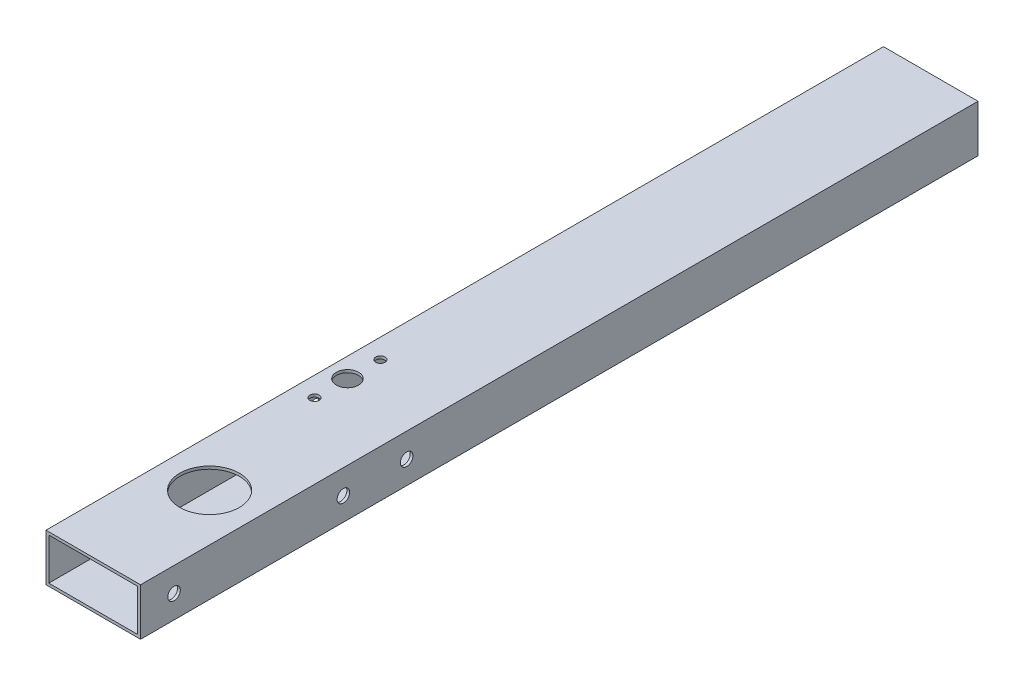
ISO-10303-21;
HEADER;
FILE_DESCRIPTION(('STEP AP214'),'2;1');
FILE_NAME('part.step','',(''),(''),'','','');
FILE_SCHEMA(('AUTOMOTIVE_DESIGN { 1 0 10303 214 1 1 1 1 }'));
ENDSEC;
DATA;
#1=APPLICATION_CONTEXT('core data for automotive mechanical design processes');
#2=APPLICATION_PROTOCOL_DEFINITION('international standard','automotive_design',2000,#1);
#3=PRODUCT_CONTEXT('',#1,'mechanical');
#4=PRODUCT('Part','Part','',(#3));
#5=PRODUCT_RELATED_PRODUCT_CATEGORY('part','',(#4));
#6=PRODUCT_DEFINITION_FORMATION('','',#4);
#7=PRODUCT_DEFINITION_CONTEXT('part definition',#1,'design');
#8=PRODUCT_DEFINITION('design','',#6,#7);
#9=PRODUCT_DEFINITION_SHAPE('','',#8);
#10=(LENGTH_UNIT() NAMED_UNIT(*) SI_UNIT(.MILLI.,.METRE.));
#11=(NAMED_UNIT(*) PLANE_ANGLE_UNIT() SI_UNIT($,.RADIAN.));
#12=(NAMED_UNIT(*) SI_UNIT($,.STERADIAN.) SOLID_ANGLE_UNIT());
#13=UNCERTAINTY_MEASURE_WITH_UNIT(LENGTH_MEASURE(1.E-05),#10,'distance_accuracy_value','');
#14=(GEOMETRIC_REPRESENTATION_CONTEXT(3) GLOBAL_UNCERTAINTY_ASSIGNED_CONTEXT((#13)) GLOBAL_UNIT_ASSIGNED_CONTEXT((#10,
#11,#12)) REPRESENTATION_CONTEXT('',''));
#15=CARTESIAN_POINT('',(0.,0.,0.));
#16=DIRECTION('',(0.,0.,1.));
#17=DIRECTION('',(1.,0.,0.));
#18=AXIS2_PLACEMENT_3D('',#15,#16,#17);
#19=CARTESIAN_POINT('',(0.,0.,450.));
#20=DIRECTION('',(0.,0.,-1.));
#21=DIRECTION('',(-1.,0.,0.));
#22=AXIS2_PLACEMENT_3D('',#19,#20,#21);
#23=PLANE('',#22);
#24=DIRECTION('',(0.,1.,0.));
#25=VECTOR('',#24,1.);
#26=CARTESIAN_POINT('',(25.4,-12.7,450.));
#27=LINE('',#26,#25);
#28=CARTESIAN_POINT('',(25.4,-12.7,450.));
#29=VERTEX_POINT('',#28);
#30=CARTESIAN_POINT('',(25.4,12.6999999999999,450.));
#31=VERTEX_POINT('',#30);
#32=EDGE_CURVE('E141',#29,#31,#27,.T.);
#33=ORIENTED_EDGE('',*,*,#32,.T.);
#34=DIRECTION('',(-1.,0.,0.));
#35=VECTOR('',#34,1.);
#36=CARTESIAN_POINT('',(-25.4,12.6999999999999,450.));
#37=LINE('',#36,#35);
#38=CARTESIAN_POINT('',(-25.4,12.6999999999999,450.));
#39=VERTEX_POINT('',#38);
#40=EDGE_CURVE('E144',#31,#39,#37,.T.);
#41=ORIENTED_EDGE('',*,*,#40,.T.);
#42=DIRECTION('',(0.,-1.,0.));
#43=VECTOR('',#42,1.);
#44=CARTESIAN_POINT('',(-25.4,-12.7,450.));
#45=LINE('',#44,#43);
#46=CARTESIAN_POINT('',(-25.4,-12.7,450.));
#47=VERTEX_POINT('',#46);
#48=EDGE_CURVE('E147',#39,#47,#45,.T.);
#49=ORIENTED_EDGE('',*,*,#48,.T.);
#50=DIRECTION('',(1.,0.,0.));
#51=VECTOR('',#50,1.);
#52=CARTESIAN_POINT('',(-25.4,-12.7,450.));
#53=LINE('',#52,#51);
#54=EDGE_CURVE('E149',#47,#29,#53,.T.);
#55=ORIENTED_EDGE('',*,*,#54,.T.);
#56=EDGE_LOOP('',(#33,#41,#49,#55));
#57=FACE_BOUND('',#56,.T.);
#58=DIRECTION('',(0.,-1.,0.));
#59=VECTOR('',#58,1.);
#60=CARTESIAN_POINT('',(-23.9,-11.2,450.));
#61=LINE('',#60,#59);
#62=CARTESIAN_POINT('',(-23.9,11.1999999999999,450.));
#63=VERTEX_POINT('',#62);
#64=CARTESIAN_POINT('',(-23.9,-11.2,450.));
#65=VERTEX_POINT('',#64);
#66=EDGE_CURVE('E103',#63,#65,#61,.T.);
#67=ORIENTED_EDGE('',*,*,#66,.F.);
#68=DIRECTION('',(-1.,0.,0.));
#69=VECTOR('',#68,1.);
#70=CARTESIAN_POINT('',(-23.9,11.1999999999999,450.));
#71=LINE('',#70,#69);
#72=CARTESIAN_POINT('',(23.9,11.1999999999999,450.));
#73=VERTEX_POINT('',#72);
#74=EDGE_CURVE('E125',#73,#63,#71,.T.);
#75=ORIENTED_EDGE('',*,*,#74,.F.);
#76=DIRECTION('',(0.,1.,0.));
#77=VECTOR('',#76,1.);
#78=CARTESIAN_POINT('',(23.9,-11.2,450.));
#79=LINE('',#78,#77);
#80=CARTESIAN_POINT('',(23.9,-11.2,450.));
#81=VERTEX_POINT('',#80);
#82=EDGE_CURVE('E123',#81,#73,#79,.T.);
#83=ORIENTED_EDGE('',*,*,#82,.F.);
#84=DIRECTION('',(1.,0.,0.));
#85=VECTOR('',#84,1.);
#86=CARTESIAN_POINT('',(-23.9,-11.2,450.));
#87=LINE('',#86,#85);
#88=EDGE_CURVE('E111',#65,#81,#87,.T.);
#89=ORIENTED_EDGE('',*,*,#88,.F.);
#90=EDGE_LOOP('',(#67,#75,#83,#89));
#91=FACE_BOUND('',#90,.T.);
#92=ADVANCED_FACE('F36',(#57,#91),#23,.F.);
#93=CARTESIAN_POINT('',(0.,0.,0.));
#94=DIRECTION('',(0.,0.,-1.));
#95=DIRECTION('',(-1.,0.,0.));
#96=AXIS2_PLACEMENT_3D('',#93,#94,#95);
#97=PLANE('',#96);
#98=DIRECTION('',(0.,1.,0.));
#99=VECTOR('',#98,1.);
#100=CARTESIAN_POINT('',(25.4,-12.7,0.));
#101=LINE('',#100,#99);
#102=CARTESIAN_POINT('',(25.4,-12.7,0.));
#103=VERTEX_POINT('',#102);
#104=CARTESIAN_POINT('',(25.4,12.6999999999999,0.));
#105=VERTEX_POINT('',#104);
#106=EDGE_CURVE('E119',#103,#105,#101,.T.);
#107=ORIENTED_EDGE('',*,*,#106,.F.);
#108=DIRECTION('',(1.,0.,0.));
#109=VECTOR('',#108,1.);
#110=CARTESIAN_POINT('',(-25.4,-12.7,0.));
#111=LINE('',#110,#109);
#112=CARTESIAN_POINT('',(-25.4,-12.7,0.));
#113=VERTEX_POINT('',#112);
#114=EDGE_CURVE('E145',#113,#103,#111,.T.);
#115=ORIENTED_EDGE('',*,*,#114,.F.);
#116=DIRECTION('',(0.,-1.,0.));
#117=VECTOR('',#116,1.);
#118=CARTESIAN_POINT('',(-25.4,-12.7,0.));
#119=LINE('',#118,#117);
#120=CARTESIAN_POINT('',(-25.4,12.6999999999999,0.));
#121=VERTEX_POINT('',#120);
#122=EDGE_CURVE('E156',#121,#113,#119,.T.);
#123=ORIENTED_EDGE('',*,*,#122,.F.);
#124=DIRECTION('',(-1.,0.,0.));
#125=VECTOR('',#124,1.);
#126=CARTESIAN_POINT('',(-25.4,12.6999999999999,0.));
#127=LINE('',#126,#125);
#128=EDGE_CURVE('E154',#105,#121,#127,.T.);
#129=ORIENTED_EDGE('',*,*,#128,.F.);
#130=EDGE_LOOP('',(#107,#115,#123,#129));
#131=FACE_BOUND('',#130,.T.);
#132=DIRECTION('',(-1.,0.,0.));
#133=VECTOR('',#132,1.);
#134=CARTESIAN_POINT('',(-23.9,11.1999999999999,0.));
#135=LINE('',#134,#133);
#136=CARTESIAN_POINT('',(23.9,11.1999999999999,0.));
#137=VERTEX_POINT('',#136);
#138=CARTESIAN_POINT('',(-23.9,11.1999999999999,0.));
#139=VERTEX_POINT('',#138);
#140=EDGE_CURVE('E112',#137,#139,#135,.T.);
#141=ORIENTED_EDGE('',*,*,#140,.T.);
#142=DIRECTION('',(0.,-1.,0.));
#143=VECTOR('',#142,1.);
#144=CARTESIAN_POINT('',(-23.9,-11.2,0.));
#145=LINE('',#144,#143);
#146=CARTESIAN_POINT('',(-23.9,-11.2,0.));
#147=VERTEX_POINT('',#146);
#148=EDGE_CURVE('E61',#139,#147,#145,.T.);
#149=ORIENTED_EDGE('',*,*,#148,.T.);
#150=DIRECTION('',(1.,0.,0.));
#151=VECTOR('',#150,1.);
#152=CARTESIAN_POINT('',(-23.9,-11.2,0.));
#153=LINE('',#152,#151);
#154=CARTESIAN_POINT('',(23.9,-11.2,0.));
#155=VERTEX_POINT('',#154);
#156=EDGE_CURVE('E118',#147,#155,#153,.T.);
#157=ORIENTED_EDGE('',*,*,#156,.T.);
#158=DIRECTION('',(0.,1.,0.));
#159=VECTOR('',#158,1.);
#160=CARTESIAN_POINT('',(23.9,-11.2,0.));
#161=LINE('',#160,#159);
#162=EDGE_CURVE('E133',#155,#137,#161,.T.);
#163=ORIENTED_EDGE('',*,*,#162,.T.);
#164=EDGE_LOOP('',(#141,#149,#157,#163));
#165=FACE_BOUND('',#164,.T.);
#166=ADVANCED_FACE('F254',(#131,#165),#97,.T.);
#167=CARTESIAN_POINT('',(25.4,-12.7,450.));
#168=DIRECTION('',(-1.,0.,0.));
#169=DIRECTION('',(0.,0.,1.));
#170=AXIS2_PLACEMENT_3D('',#167,#168,#169);
#171=PLANE('',#170);
#172=CARTESIAN_POINT('',(25.4,-0.399999999997958,432.000000000005));
#173=DIRECTION('',(-1.,0.,0.));
#174=DIRECTION('',(0.,0.,1.));
#175=AXIS2_PLACEMENT_3D('',#172,#173,#174);
#176=CIRCLE('',#175,3.37819999999999);
#177=CARTESIAN_POINT('',(25.4,-0.399999999997958,435.378200000005));
#178=VERTEX_POINT('',#177);
#179=EDGE_CURVE('E185',#178,#178,#176,.T.);
#180=ORIENTED_EDGE('',*,*,#179,.T.);
#181=EDGE_LOOP('',(#180));
#182=FACE_BOUND('',#181,.T.);
#183=CARTESIAN_POINT('',(25.4,-0.400000000004175,341.000000000002));
#184=DIRECTION('',(-1.,0.,0.));
#185=DIRECTION('',(0.,0.,1.));
#186=AXIS2_PLACEMENT_3D('',#183,#184,#185);
#187=CIRCLE('',#186,3.37819999999999);
#188=CARTESIAN_POINT('',(25.4,-0.400000000004175,344.378200000002));
#189=VERTEX_POINT('',#188);
#190=EDGE_CURVE('E180',#189,#189,#187,.T.);
#191=ORIENTED_EDGE('',*,*,#190,.T.);
#192=EDGE_LOOP('',(#191));
#193=FACE_BOUND('',#192,.T.);
#194=CARTESIAN_POINT('',(25.4,-0.400000000000733,307.000000000002));
#195=DIRECTION('',(-1.,0.,0.));
#196=DIRECTION('',(0.,0.,1.));
#197=AXIS2_PLACEMENT_3D('',#194,#195,#196);
#198=CIRCLE('',#197,3.37819999999999);
#199=CARTESIAN_POINT('',(25.4,-0.400000000000733,310.378200000002));
#200=VERTEX_POINT('',#199);
#201=EDGE_CURVE('E175',#200,#200,#198,.T.);
#202=ORIENTED_EDGE('',*,*,#201,.T.);
#203=EDGE_LOOP('',(#202));
#204=FACE_BOUND('',#203,.T.);
#205=ORIENTED_EDGE('',*,*,#106,.T.);
#206=DIRECTION('',(0.,0.,-1.));
#207=VECTOR('',#206,1.);
#208=CARTESIAN_POINT('',(25.4,12.6999999999999,450.));
#209=LINE('',#208,#207);
#210=EDGE_CURVE('E11',#31,#105,#209,.T.);
#211=ORIENTED_EDGE('',*,*,#210,.F.);
#212=ORIENTED_EDGE('',*,*,#32,.F.);
#213=DIRECTION('',(0.,0.,-1.));
#214=VECTOR('',#213,1.);
#215=CARTESIAN_POINT('',(25.4,-12.7,450.));
#216=LINE('',#215,#214);
#217=EDGE_CURVE('E151',#29,#103,#216,.T.);
#218=ORIENTED_EDGE('',*,*,#217,.T.);
#219=EDGE_LOOP('',(#205,#211,#212,#218));
#220=FACE_BOUND('',#219,.T.);
#221=ADVANCED_FACE('F38',(#182,#193,#204,#220),#171,.F.);
#222=CARTESIAN_POINT('',(-25.4,12.6999999999999,450.));
#223=DIRECTION('',(0.,-1.,0.));
#224=DIRECTION('',(0.,0.,-1.));
#225=AXIS2_PLACEMENT_3D('',#222,#223,#224);
#226=PLANE('',#225);
#227=CARTESIAN_POINT('',(-14.8999999999997,12.6999999999999,316.2));
#228=DIRECTION('',(0.,1.,0.));
#229=DIRECTION('',(0.,0.,1.));
#230=AXIS2_PLACEMENT_3D('',#227,#228,#229);
#231=CIRCLE('',#230,2.5);
#232=CARTESIAN_POINT('',(-14.8999999999997,12.6999999999999,318.7));
#233=VERTEX_POINT('',#232);
#234=EDGE_CURVE('E281',#233,#233,#231,.T.);
#235=ORIENTED_EDGE('',*,*,#234,.F.);
#236=EDGE_LOOP('',(#235));
#237=FACE_BOUND('',#236,.T.);
#238=CARTESIAN_POINT('',(-14.9,12.6999999999999,280.8));
#239=DIRECTION('',(0.,1.,0.));
#240=DIRECTION('',(0.,0.,1.));
#241=AXIS2_PLACEMENT_3D('',#238,#239,#240);
#242=CIRCLE('',#241,2.5);
#243=CARTESIAN_POINT('',(-14.9,12.6999999999999,283.3));
#244=VERTEX_POINT('',#243);
#245=EDGE_CURVE('E285',#244,#244,#242,.T.);
#246=ORIENTED_EDGE('',*,*,#245,.F.);
#247=EDGE_LOOP('',(#246));
#248=FACE_BOUND('',#247,.T.);
#249=CARTESIAN_POINT('',(-14.9,12.6999999999999,298.5));
#250=DIRECTION('',(0.,1.,0.));
#251=DIRECTION('',(0.,0.,1.));
#252=AXIS2_PLACEMENT_3D('',#249,#250,#251);
#253=CIRCLE('',#252,6.);
#254=CARTESIAN_POINT('',(-14.9,12.6999999999999,304.5));
#255=VERTEX_POINT('',#254);
#256=EDGE_CURVE('E289',#255,#255,#253,.T.);
#257=ORIENTED_EDGE('',*,*,#256,.F.);
#258=EDGE_LOOP('',(#257));
#259=FACE_BOUND('',#258,.T.);
#260=CARTESIAN_POINT('',(0.,12.6999999999999,387.5));
#261=DIRECTION('',(0.,1.,0.));
#262=DIRECTION('',(0.,0.,1.));
#263=AXIS2_PLACEMENT_3D('',#260,#261,#262);
#264=CIRCLE('',#263,16.);
#265=CARTESIAN_POINT('',(0.,12.6999999999999,403.5));
#266=VERTEX_POINT('',#265);
#267=EDGE_CURVE('E170',#266,#266,#264,.T.);
#268=ORIENTED_EDGE('',*,*,#267,.F.);
#269=EDGE_LOOP('',(#268));
#270=FACE_BOUND('',#269,.T.);
#271=ORIENTED_EDGE('',*,*,#128,.T.);
#272=DIRECTION('',(0.,0.,-1.));
#273=VECTOR('',#272,1.);
#274=CARTESIAN_POINT('',(-25.4,12.6999999999999,450.));
#275=LINE('',#274,#273);
#276=EDGE_CURVE('E45',#39,#121,#275,.T.);
#277=ORIENTED_EDGE('',*,*,#276,.F.);
#278=ORIENTED_EDGE('',*,*,#40,.F.);
#279=ORIENTED_EDGE('',*,*,#210,.T.);
#280=EDGE_LOOP('',(#271,#277,#278,#279));
#281=FACE_BOUND('',#280,.T.);
#282=ADVANCED_FACE('F270',(#237,#248,#259,#270,#281),#226,.F.);
#283=CARTESIAN_POINT('',(-25.4,-12.7,450.));
#284=DIRECTION('',(1.,0.,0.));
#285=DIRECTION('',(0.,0.,-1.));
#286=AXIS2_PLACEMENT_3D('',#283,#284,#285);
#287=PLANE('',#286);
#288=CARTESIAN_POINT('',(-25.4,-0.399999999997958,432.000000000005));
#289=DIRECTION('',(1.,0.,0.));
#290=DIRECTION('',(0.,0.,-1.));
#291=AXIS2_PLACEMENT_3D('',#288,#289,#290);
#292=CIRCLE('',#291,3.37819999999999);
#293=CARTESIAN_POINT('',(-25.4,-0.399999999997958,428.621800000005));
#294=VERTEX_POINT('',#293);
#295=EDGE_CURVE('E211',#294,#294,#292,.T.);
#296=ORIENTED_EDGE('',*,*,#295,.T.);
#297=EDGE_LOOP('',(#296));
#298=FACE_BOUND('',#297,.T.);
#299=CARTESIAN_POINT('',(-25.4,-0.400000000004175,341.000000000002));
#300=DIRECTION('',(1.,0.,0.));
#301=DIRECTION('',(0.,0.,-1.));
#302=AXIS2_PLACEMENT_3D('',#299,#300,#301);
#303=CIRCLE('',#302,3.37819999999999);
#304=CARTESIAN_POINT('',(-25.4,-0.400000000004175,337.621800000002));
#305=VERTEX_POINT('',#304);
#306=EDGE_CURVE('E218',#305,#305,#303,.T.);
#307=ORIENTED_EDGE('',*,*,#306,.T.);
#308=EDGE_LOOP('',(#307));
#309=FACE_BOUND('',#308,.T.);
#310=CARTESIAN_POINT('',(-25.4,-0.400000000000733,307.000000000002));
#311=DIRECTION('',(1.,0.,0.));
#312=DIRECTION('',(0.,0.,-1.));
#313=AXIS2_PLACEMENT_3D('',#310,#311,#312);
#314=CIRCLE('',#313,3.37819999999999);
#315=CARTESIAN_POINT('',(-25.4,-0.400000000000733,303.621800000002));
#316=VERTEX_POINT('',#315);
#317=EDGE_CURVE('E225',#316,#316,#314,.T.);
#318=ORIENTED_EDGE('',*,*,#317,.T.);
#319=EDGE_LOOP('',(#318));
#320=FACE_BOUND('',#319,.T.);
#321=ORIENTED_EDGE('',*,*,#122,.T.);
#322=DIRECTION('',(0.,0.,-1.));
#323=VECTOR('',#322,1.);
#324=CARTESIAN_POINT('',(-25.4,-12.7,450.));
#325=LINE('',#324,#323);
#326=EDGE_CURVE('E161',#47,#113,#325,.T.);
#327=ORIENTED_EDGE('',*,*,#326,.F.);
#328=ORIENTED_EDGE('',*,*,#48,.F.);
#329=ORIENTED_EDGE('',*,*,#276,.T.);
#330=EDGE_LOOP('',(#321,#327,#328,#329));
#331=FACE_BOUND('',#330,.T.);
#332=ADVANCED_FACE('F267',(#298,#309,#320,#331),#287,.F.);
#333=CARTESIAN_POINT('',(-25.4,-12.7,450.));
#334=DIRECTION('',(0.,1.,0.));
#335=DIRECTION('',(0.,0.,1.));
#336=AXIS2_PLACEMENT_3D('',#333,#334,#335);
#337=PLANE('',#336);
#338=CARTESIAN_POINT('',(-14.8999999999997,-12.7,316.2));
#339=DIRECTION('',(0.,1.,0.));
#340=DIRECTION('',(0.,0.,1.));
#341=AXIS2_PLACEMENT_3D('',#338,#339,#340);
#342=CIRCLE('',#341,2.5);
#343=CARTESIAN_POINT('',(-14.8999999999997,-12.7,318.7));
#344=VERTEX_POINT('',#343);
#345=EDGE_CURVE('E341',#344,#344,#342,.F.);
#346=ORIENTED_EDGE('',*,*,#345,.F.);
#347=EDGE_LOOP('',(#346));
#348=FACE_BOUND('',#347,.T.);
#349=CARTESIAN_POINT('',(-14.9,-12.7,280.8));
#350=DIRECTION('',(0.,1.,0.));
#351=DIRECTION('',(0.,0.,1.));
#352=AXIS2_PLACEMENT_3D('',#349,#350,#351);
#353=CIRCLE('',#352,2.5);
#354=CARTESIAN_POINT('',(-14.9,-12.7,283.3));
#355=VERTEX_POINT('',#354);
#356=EDGE_CURVE('E338',#355,#355,#353,.F.);
#357=ORIENTED_EDGE('',*,*,#356,.F.);
#358=EDGE_LOOP('',(#357));
#359=FACE_BOUND('',#358,.T.);
#360=CARTESIAN_POINT('',(-14.9,-12.7,298.5));
#361=DIRECTION('',(0.,1.,0.));
#362=DIRECTION('',(0.,0.,1.));
#363=AXIS2_PLACEMENT_3D('',#360,#361,#362);
#364=CIRCLE('',#363,6.);
#365=CARTESIAN_POINT('',(-14.9,-12.7,304.5));
#366=VERTEX_POINT('',#365);
#367=EDGE_CURVE('E189',#366,#366,#364,.F.);
#368=ORIENTED_EDGE('',*,*,#367,.F.);
#369=EDGE_LOOP('',(#368));
#370=FACE_BOUND('',#369,.T.);
#371=CARTESIAN_POINT('',(0.,-12.7,387.5));
#372=DIRECTION('',(0.,1.,0.));
#373=DIRECTION('',(0.,0.,1.));
#374=AXIS2_PLACEMENT_3D('',#371,#372,#373);
#375=CIRCLE('',#374,16.);
#376=CARTESIAN_POINT('',(0.,-12.7,403.5));
#377=VERTEX_POINT('',#376);
#378=EDGE_CURVE('E131',#377,#377,#375,.T.);
#379=ORIENTED_EDGE('',*,*,#378,.T.);
#380=EDGE_LOOP('',(#379));
#381=FACE_BOUND('',#380,.T.);
#382=ORIENTED_EDGE('',*,*,#114,.T.);
#383=ORIENTED_EDGE('',*,*,#217,.F.);
#384=ORIENTED_EDGE('',*,*,#54,.F.);
#385=ORIENTED_EDGE('',*,*,#326,.T.);
#386=EDGE_LOOP('',(#382,#383,#384,#385));
#387=FACE_BOUND('',#386,.T.);
#388=ADVANCED_FACE('F234',(#348,#359,#370,#381,#387),#337,.F.);
#389=CARTESIAN_POINT('',(-23.9,-11.2,450.));
#390=DIRECTION('',(1.,0.,0.));
#391=DIRECTION('',(0.,0.,-1.));
#392=AXIS2_PLACEMENT_3D('',#389,#390,#391);
#393=PLANE('',#392);
#394=CARTESIAN_POINT('',(-23.8999999999999,-0.399999999997958,432.000000000005));
#395=DIRECTION('',(1.,0.,0.));
#396=DIRECTION('',(0.,0.,-1.));
#397=AXIS2_PLACEMENT_3D('',#394,#395,#396);
#398=CIRCLE('',#397,3.37819999999999);
#399=CARTESIAN_POINT('',(-23.8999999999999,-0.399999999997958,428.621800000005));
#400=VERTEX_POINT('',#399);
#401=EDGE_CURVE('E184',#400,#400,#398,.T.);
#402=ORIENTED_EDGE('',*,*,#401,.F.);
#403=EDGE_LOOP('',(#402));
#404=FACE_BOUND('',#403,.T.);
#405=CARTESIAN_POINT('',(-23.9,-0.400000000004175,341.000000000002));
#406=DIRECTION('',(1.,0.,0.));
#407=DIRECTION('',(0.,0.,-1.));
#408=AXIS2_PLACEMENT_3D('',#405,#406,#407);
#409=CIRCLE('',#408,3.37819999999999);
#410=CARTESIAN_POINT('',(-23.9,-0.400000000004175,337.621800000002));
#411=VERTEX_POINT('',#410);
#412=EDGE_CURVE('E179',#411,#411,#409,.T.);
#413=ORIENTED_EDGE('',*,*,#412,.F.);
#414=EDGE_LOOP('',(#413));
#415=FACE_BOUND('',#414,.T.);
#416=CARTESIAN_POINT('',(-23.9,-0.400000000000733,307.000000000002));
#417=DIRECTION('',(1.,0.,0.));
#418=DIRECTION('',(0.,0.,-1.));
#419=AXIS2_PLACEMENT_3D('',#416,#417,#418);
#420=CIRCLE('',#419,3.37819999999999);
#421=CARTESIAN_POINT('',(-23.9,-0.400000000000733,303.621800000002));
#422=VERTEX_POINT('',#421);
#423=EDGE_CURVE('E174',#422,#422,#420,.T.);
#424=ORIENTED_EDGE('',*,*,#423,.F.);
#425=EDGE_LOOP('',(#424));
#426=FACE_BOUND('',#425,.T.);
#427=ORIENTED_EDGE('',*,*,#148,.F.);
#428=DIRECTION('',(0.,0.,-1.));
#429=VECTOR('',#428,1.);
#430=CARTESIAN_POINT('',(-23.9,11.1999999999999,450.));
#431=LINE('',#430,#429);
#432=EDGE_CURVE('E107',#63,#139,#431,.T.);
#433=ORIENTED_EDGE('',*,*,#432,.F.);
#434=ORIENTED_EDGE('',*,*,#66,.T.);
#435=DIRECTION('',(0.,0.,-1.));
#436=VECTOR('',#435,1.);
#437=CARTESIAN_POINT('',(-23.9,-11.2,450.));
#438=LINE('',#437,#436);
#439=EDGE_CURVE('E106',#65,#147,#438,.T.);
#440=ORIENTED_EDGE('',*,*,#439,.T.);
#441=EDGE_LOOP('',(#427,#433,#434,#440));
#442=FACE_BOUND('',#441,.T.);
#443=ADVANCED_FACE('F105',(#404,#415,#426,#442),#393,.T.);
#444=CARTESIAN_POINT('',(-23.9,-11.2,450.));
#445=DIRECTION('',(0.,1.,0.));
#446=DIRECTION('',(0.,0.,1.));
#447=AXIS2_PLACEMENT_3D('',#444,#445,#446);
#448=PLANE('',#447);
#449=CARTESIAN_POINT('',(-14.8999999999997,-11.2,316.2));
#450=DIRECTION('',(0.,1.,0.));
#451=DIRECTION('',(0.,0.,1.));
#452=AXIS2_PLACEMENT_3D('',#449,#450,#451);
#453=CIRCLE('',#452,2.5);
#454=CARTESIAN_POINT('',(-14.8999999999997,-11.2,318.7));
#455=VERTEX_POINT('',#454);
#456=EDGE_CURVE('E204',#455,#455,#453,.T.);
#457=ORIENTED_EDGE('',*,*,#456,.F.);
#458=EDGE_LOOP('',(#457));
#459=FACE_BOUND('',#458,.T.);
#460=CARTESIAN_POINT('',(-14.9,-11.2,280.8));
#461=DIRECTION('',(0.,1.,0.));
#462=DIRECTION('',(0.,0.,1.));
#463=AXIS2_PLACEMENT_3D('',#460,#461,#462);
#464=CIRCLE('',#463,2.5);
#465=CARTESIAN_POINT('',(-14.9,-11.2,283.3));
#466=VERTEX_POINT('',#465);
#467=EDGE_CURVE('E192',#466,#466,#464,.T.);
#468=ORIENTED_EDGE('',*,*,#467,.F.);
#469=EDGE_LOOP('',(#468));
#470=FACE_BOUND('',#469,.T.);
#471=CARTESIAN_POINT('',(-14.9,-11.2,298.5));
#472=DIRECTION('',(0.,1.,0.));
#473=DIRECTION('',(0.,0.,1.));
#474=AXIS2_PLACEMENT_3D('',#471,#472,#473);
#475=CIRCLE('',#474,6.);
#476=CARTESIAN_POINT('',(-14.9,-11.2,304.5));
#477=VERTEX_POINT('',#476);
#478=EDGE_CURVE('E188',#477,#477,#475,.T.);
#479=ORIENTED_EDGE('',*,*,#478,.F.);
#480=EDGE_LOOP('',(#479));
#481=FACE_BOUND('',#480,.T.);
#482=CARTESIAN_POINT('',(0.,-11.2,387.5));
#483=DIRECTION('',(0.,1.,0.));
#484=DIRECTION('',(0.,0.,1.));
#485=AXIS2_PLACEMENT_3D('',#482,#483,#484);
#486=CIRCLE('',#485,16.);
#487=CARTESIAN_POINT('',(0.,-11.2,403.5));
#488=VERTEX_POINT('',#487);
#489=EDGE_CURVE('E169',#488,#488,#486,.T.);
#490=ORIENTED_EDGE('',*,*,#489,.F.);
#491=EDGE_LOOP('',(#490));
#492=FACE_BOUND('',#491,.T.);
#493=ORIENTED_EDGE('',*,*,#156,.F.);
#494=ORIENTED_EDGE('',*,*,#439,.F.);
#495=ORIENTED_EDGE('',*,*,#88,.T.);
#496=DIRECTION('',(0.,0.,-1.));
#497=VECTOR('',#496,1.);
#498=CARTESIAN_POINT('',(23.9,-11.2,450.));
#499=LINE('',#498,#497);
#500=EDGE_CURVE('E120',#81,#155,#499,.T.);
#501=ORIENTED_EDGE('',*,*,#500,.T.);
#502=EDGE_LOOP('',(#493,#494,#495,#501));
#503=FACE_BOUND('',#502,.T.);
#504=ADVANCED_FACE('F115',(#459,#470,#481,#492,#503),#448,.T.);
#505=CARTESIAN_POINT('',(23.9,-11.2,450.));
#506=DIRECTION('',(-1.,0.,0.));
#507=DIRECTION('',(0.,0.,1.));
#508=AXIS2_PLACEMENT_3D('',#505,#506,#507);
#509=PLANE('',#508);
#510=CARTESIAN_POINT('',(23.9,-0.399999999997958,432.000000000005));
#511=DIRECTION('',(-1.,0.,0.));
#512=DIRECTION('',(0.,0.,1.));
#513=AXIS2_PLACEMENT_3D('',#510,#511,#512);
#514=CIRCLE('',#513,3.37819999999999);
#515=CARTESIAN_POINT('',(23.9,-0.399999999997958,435.378200000005));
#516=VERTEX_POINT('',#515);
#517=EDGE_CURVE('E181',#516,#516,#514,.T.);
#518=ORIENTED_EDGE('',*,*,#517,.F.);
#519=EDGE_LOOP('',(#518));
#520=FACE_BOUND('',#519,.T.);
#521=CARTESIAN_POINT('',(23.9,-0.400000000004175,341.000000000002));
#522=DIRECTION('',(-1.,0.,0.));
#523=DIRECTION('',(0.,0.,1.));
#524=AXIS2_PLACEMENT_3D('',#521,#522,#523);
#525=CIRCLE('',#524,3.37819999999999);
#526=CARTESIAN_POINT('',(23.9,-0.400000000004175,344.378200000002));
#527=VERTEX_POINT('',#526);
#528=EDGE_CURVE('E176',#527,#527,#525,.T.);
#529=ORIENTED_EDGE('',*,*,#528,.F.);
#530=EDGE_LOOP('',(#529));
#531=FACE_BOUND('',#530,.T.);
#532=CARTESIAN_POINT('',(23.9,-0.400000000000733,307.000000000002));
#533=DIRECTION('',(-1.,0.,0.));
#534=DIRECTION('',(0.,0.,1.));
#535=AXIS2_PLACEMENT_3D('',#532,#533,#534);
#536=CIRCLE('',#535,3.37819999999999);
#537=CARTESIAN_POINT('',(23.9,-0.400000000000733,310.378200000002));
#538=VERTEX_POINT('',#537);
#539=EDGE_CURVE('E171',#538,#538,#536,.T.);
#540=ORIENTED_EDGE('',*,*,#539,.F.);
#541=EDGE_LOOP('',(#540));
#542=FACE_BOUND('',#541,.T.);
#543=ORIENTED_EDGE('',*,*,#162,.F.);
#544=ORIENTED_EDGE('',*,*,#500,.F.);
#545=ORIENTED_EDGE('',*,*,#82,.T.);
#546=DIRECTION('',(0.,0.,-1.));
#547=VECTOR('',#546,1.);
#548=CARTESIAN_POINT('',(23.9,11.1999999999999,450.));
#549=LINE('',#548,#547);
#550=EDGE_CURVE('E53',#73,#137,#549,.T.);
#551=ORIENTED_EDGE('',*,*,#550,.T.);
#552=EDGE_LOOP('',(#543,#544,#545,#551));
#553=FACE_BOUND('',#552,.T.);
#554=ADVANCED_FACE('F307',(#520,#531,#542,#553),#509,.T.);
#555=CARTESIAN_POINT('',(-23.9,11.1999999999999,450.));
#556=DIRECTION('',(0.,-1.,0.));
#557=DIRECTION('',(1.,0.,0.));
#558=AXIS2_PLACEMENT_3D('',#555,#556,#557);
#559=PLANE('',#558);
#560=CARTESIAN_POINT('',(-14.8999999999997,11.1999999999999,316.2));
#561=DIRECTION('',(0.,-1.,0.));
#562=DIRECTION('',(1.,0.,0.));
#563=AXIS2_PLACEMENT_3D('',#560,#561,#562);
#564=CIRCLE('',#563,2.5);
#565=CARTESIAN_POINT('',(-12.3999999999997,11.1999999999999,316.2));
#566=VERTEX_POINT('',#565);
#567=EDGE_CURVE('E40',#566,#566,#564,.T.);
#568=ORIENTED_EDGE('',*,*,#567,.F.);
#569=EDGE_LOOP('',(#568));
#570=FACE_BOUND('',#569,.T.);
#571=CARTESIAN_POINT('',(-14.9,11.1999999999999,280.8));
#572=DIRECTION('',(0.,-1.,0.));
#573=DIRECTION('',(1.,0.,0.));
#574=AXIS2_PLACEMENT_3D('',#571,#572,#573);
#575=CIRCLE('',#574,2.5);
#576=CARTESIAN_POINT('',(-12.4,11.1999999999999,280.8));
#577=VERTEX_POINT('',#576);
#578=EDGE_CURVE('E190',#577,#577,#575,.T.);
#579=ORIENTED_EDGE('',*,*,#578,.F.);
#580=EDGE_LOOP('',(#579));
#581=FACE_BOUND('',#580,.T.);
#582=CARTESIAN_POINT('',(-14.9,11.1999999999999,298.5));
#583=DIRECTION('',(0.,-1.,0.));
#584=DIRECTION('',(1.,0.,0.));
#585=AXIS2_PLACEMENT_3D('',#582,#583,#584);
#586=CIRCLE('',#585,6.);
#587=CARTESIAN_POINT('',(-8.90000000000002,11.1999999999999,298.5));
#588=VERTEX_POINT('',#587);
#589=EDGE_CURVE('E186',#588,#588,#586,.T.);
#590=ORIENTED_EDGE('',*,*,#589,.F.);
#591=EDGE_LOOP('',(#590));
#592=FACE_BOUND('',#591,.T.);
#593=CARTESIAN_POINT('',(0.,11.1999999999999,387.5));
#594=DIRECTION('',(0.,-1.,0.));
#595=DIRECTION('',(1.,0.,0.));
#596=AXIS2_PLACEMENT_3D('',#593,#594,#595);
#597=CIRCLE('',#596,16.);
#598=CARTESIAN_POINT('',(16.,11.1999999999999,387.5));
#599=VERTEX_POINT('',#598);
#600=EDGE_CURVE('E166',#599,#599,#597,.T.);
#601=ORIENTED_EDGE('',*,*,#600,.F.);
#602=EDGE_LOOP('',(#601));
#603=FACE_BOUND('',#602,.T.);
#604=ORIENTED_EDGE('',*,*,#140,.F.);
#605=ORIENTED_EDGE('',*,*,#550,.F.);
#606=ORIENTED_EDGE('',*,*,#74,.T.);
#607=ORIENTED_EDGE('',*,*,#432,.T.);
#608=EDGE_LOOP('',(#604,#605,#606,#607));
#609=FACE_BOUND('',#608,.T.);
#610=ADVANCED_FACE('F250',(#570,#581,#592,#603,#609),#559,.T.);
#611=CARTESIAN_POINT('',(0.,-13.3,387.5));
#612=DIRECTION('',(0.,1.,0.));
#613=DIRECTION('',(0.,0.,1.));
#614=AXIS2_PLACEMENT_3D('',#611,#612,#613);
#615=CYLINDRICAL_SURFACE('',#614,16.);
#616=ORIENTED_EDGE('',*,*,#600,.T.);
#617=EDGE_LOOP('',(#616));
#618=FACE_BOUND('',#617,.T.);
#619=ORIENTED_EDGE('',*,*,#267,.T.);
#620=EDGE_LOOP('',(#619));
#621=FACE_BOUND('',#620,.T.);
#622=ADVANCED_FACE('F240',(#618,#621),#615,.F.);
#623=ORIENTED_EDGE('',*,*,#489,.T.);
#624=EDGE_LOOP('',(#623));
#625=FACE_BOUND('',#624,.T.);
#626=ORIENTED_EDGE('',*,*,#378,.F.);
#627=EDGE_LOOP('',(#626));
#628=FACE_BOUND('',#627,.T.);
#629=ADVANCED_FACE('F237',(#625,#628),#615,.F.);
#630=CARTESIAN_POINT('',(-26.3999999999941,-0.400000000000733,307.000000000002));
#631=DIRECTION('',(-1.,0.,0.));
#632=DIRECTION('',(0.,0.,1.));
#633=AXIS2_PLACEMENT_3D('',#630,#631,#632);
#634=CYLINDRICAL_SURFACE('',#633,3.37819999999999);
#635=ORIENTED_EDGE('',*,*,#539,.T.);
#636=EDGE_LOOP('',(#635));
#637=FACE_BOUND('',#636,.T.);
#638=ORIENTED_EDGE('',*,*,#201,.F.);
#639=EDGE_LOOP('',(#638));
#640=FACE_BOUND('',#639,.T.);
#641=ADVANCED_FACE('F239',(#637,#640),#634,.F.);
#642=ORIENTED_EDGE('',*,*,#423,.T.);
#643=EDGE_LOOP('',(#642));
#644=FACE_BOUND('',#643,.T.);
#645=ORIENTED_EDGE('',*,*,#317,.F.);
#646=EDGE_LOOP('',(#645));
#647=FACE_BOUND('',#646,.T.);
#648=ADVANCED_FACE('F247',(#644,#647),#634,.F.);
#649=CARTESIAN_POINT('',(-26.399999999994,-0.400000000004175,341.000000000002));
#650=DIRECTION('',(-1.,0.,0.));
#651=DIRECTION('',(0.,0.,1.));
#652=AXIS2_PLACEMENT_3D('',#649,#650,#651);
#653=CYLINDRICAL_SURFACE('',#652,3.37819999999999);
#654=ORIENTED_EDGE('',*,*,#528,.T.);
#655=EDGE_LOOP('',(#654));
#656=FACE_BOUND('',#655,.T.);
#657=ORIENTED_EDGE('',*,*,#190,.F.);
#658=EDGE_LOOP('',(#657));
#659=FACE_BOUND('',#658,.T.);
#660=ADVANCED_FACE('F384',(#656,#659),#653,.F.);
#661=ORIENTED_EDGE('',*,*,#412,.T.);
#662=EDGE_LOOP('',(#661));
#663=FACE_BOUND('',#662,.T.);
#664=ORIENTED_EDGE('',*,*,#306,.F.);
#665=EDGE_LOOP('',(#664));
#666=FACE_BOUND('',#665,.T.);
#667=ADVANCED_FACE('F380',(#663,#666),#653,.F.);
#668=CARTESIAN_POINT('',(-26.399999999994,-0.399999999997958,432.000000000005));
#669=DIRECTION('',(-1.,0.,0.));
#670=DIRECTION('',(0.,0.,1.));
#671=AXIS2_PLACEMENT_3D('',#668,#669,#670);
#672=CYLINDRICAL_SURFACE('',#671,3.37819999999999);
#673=ORIENTED_EDGE('',*,*,#517,.T.);
#674=EDGE_LOOP('',(#673));
#675=FACE_BOUND('',#674,.T.);
#676=ORIENTED_EDGE('',*,*,#179,.F.);
#677=EDGE_LOOP('',(#676));
#678=FACE_BOUND('',#677,.T.);
#679=ADVANCED_FACE('F369',(#675,#678),#672,.F.);
#680=ORIENTED_EDGE('',*,*,#401,.T.);
#681=EDGE_LOOP('',(#680));
#682=FACE_BOUND('',#681,.T.);
#683=ORIENTED_EDGE('',*,*,#295,.F.);
#684=EDGE_LOOP('',(#683));
#685=FACE_BOUND('',#684,.T.);
#686=ADVANCED_FACE('F363',(#682,#685),#672,.F.);
#687=CARTESIAN_POINT('',(-14.9,-29.6705627484771,298.5));
#688=DIRECTION('',(0.,1.,0.));
#689=DIRECTION('',(0.,0.,1.));
#690=AXIS2_PLACEMENT_3D('',#687,#688,#689);
#691=CYLINDRICAL_SURFACE('',#690,6.);
#692=ORIENTED_EDGE('',*,*,#589,.T.);
#693=EDGE_LOOP('',(#692));
#694=FACE_BOUND('',#693,.T.);
#695=ORIENTED_EDGE('',*,*,#256,.T.);
#696=EDGE_LOOP('',(#695));
#697=FACE_BOUND('',#696,.T.);
#698=ADVANCED_FACE('F355',(#694,#697),#691,.F.);
#699=CARTESIAN_POINT('',(-14.9,-29.6705627484771,280.8));
#700=DIRECTION('',(0.,1.,0.));
#701=DIRECTION('',(0.,0.,1.));
#702=AXIS2_PLACEMENT_3D('',#699,#700,#701);
#703=CYLINDRICAL_SURFACE('',#702,2.5);
#704=ORIENTED_EDGE('',*,*,#578,.T.);
#705=EDGE_LOOP('',(#704));
#706=FACE_BOUND('',#705,.T.);
#707=ORIENTED_EDGE('',*,*,#245,.T.);
#708=EDGE_LOOP('',(#707));
#709=FACE_BOUND('',#708,.T.);
#710=ADVANCED_FACE('F335',(#706,#709),#703,.F.);
#711=CARTESIAN_POINT('',(-14.8999999999997,-29.6705627484771,316.2));
#712=DIRECTION('',(0.,1.,0.));
#713=DIRECTION('',(0.,0.,1.));
#714=AXIS2_PLACEMENT_3D('',#711,#712,#713);
#715=CYLINDRICAL_SURFACE('',#714,2.5);
#716=ORIENTED_EDGE('',*,*,#567,.T.);
#717=EDGE_LOOP('',(#716));
#718=FACE_BOUND('',#717,.T.);
#719=ORIENTED_EDGE('',*,*,#234,.T.);
#720=EDGE_LOOP('',(#719));
#721=FACE_BOUND('',#720,.T.);
#722=ADVANCED_FACE('F353',(#718,#721),#715,.F.);
#723=ORIENTED_EDGE('',*,*,#478,.T.);
#724=EDGE_LOOP('',(#723));
#725=FACE_BOUND('',#724,.T.);
#726=ORIENTED_EDGE('',*,*,#367,.T.);
#727=EDGE_LOOP('',(#726));
#728=FACE_BOUND('',#727,.T.);
#729=ADVANCED_FACE('F333',(#725,#728),#691,.F.);
#730=ORIENTED_EDGE('',*,*,#467,.T.);
#731=EDGE_LOOP('',(#730));
#732=FACE_BOUND('',#731,.T.);
#733=ORIENTED_EDGE('',*,*,#356,.T.);
#734=EDGE_LOOP('',(#733));
#735=FACE_BOUND('',#734,.T.);
#736=ADVANCED_FACE('F329',(#732,#735),#703,.F.);
#737=ORIENTED_EDGE('',*,*,#456,.T.);
#738=EDGE_LOOP('',(#737));
#739=FACE_BOUND('',#738,.T.);
#740=ORIENTED_EDGE('',*,*,#345,.T.);
#741=EDGE_LOOP('',(#740));
#742=FACE_BOUND('',#741,.T.);
#743=ADVANCED_FACE('F332',(#739,#742),#715,.F.);
#744=CLOSED_SHELL('',(#92,#166,#221,#282,#332,#388,#443,#504,#554,#610,#622,#629,#641,#648,#660,
#667,#679,#686,#698,#710,#722,#729,#736,#743));
#745=MANIFOLD_SOLID_BREP('B2',#744);
#746=ADVANCED_BREP_SHAPE_REPRESENTATION('',(#18,#745),#14);
#747=SHAPE_DEFINITION_REPRESENTATION(#9,#746);
ENDSEC;
END-ISO-10303-21;
